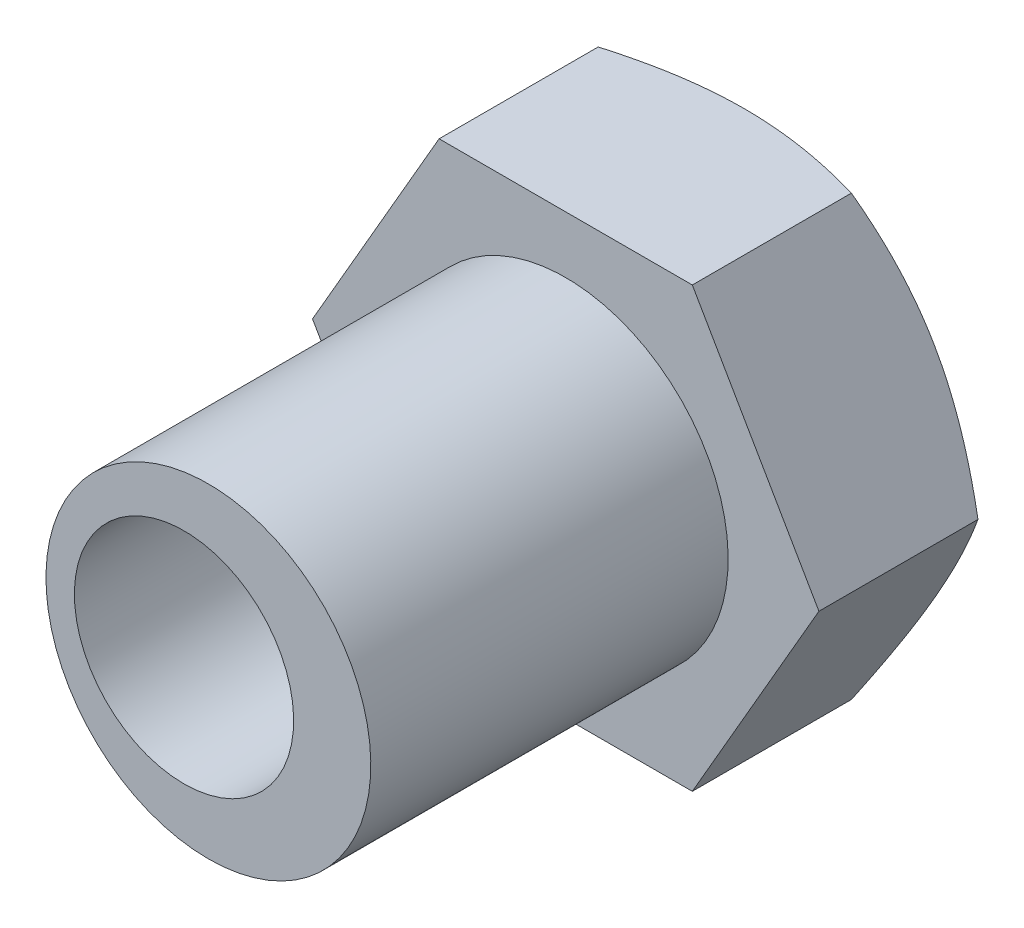
ISO-10303-21;
HEADER;
FILE_DESCRIPTION(('STEP AP214'),'2;1');
FILE_NAME('part.step','',(''),(''),'','','');
FILE_SCHEMA(('AUTOMOTIVE_DESIGN { 1 0 10303 214 1 1 1 1 }'));
ENDSEC;
DATA;
#1=APPLICATION_CONTEXT('core data for automotive mechanical design processes');
#2=APPLICATION_PROTOCOL_DEFINITION('international standard','automotive_design',2000,#1);
#3=PRODUCT_CONTEXT('',#1,'mechanical');
#4=PRODUCT('Part','Part','',(#3));
#5=PRODUCT_RELATED_PRODUCT_CATEGORY('part','',(#4));
#6=PRODUCT_DEFINITION_FORMATION('','',#4);
#7=PRODUCT_DEFINITION_CONTEXT('part definition',#1,'design');
#8=PRODUCT_DEFINITION('design','',#6,#7);
#9=PRODUCT_DEFINITION_SHAPE('','',#8);
#10=(LENGTH_UNIT() NAMED_UNIT(*) SI_UNIT(.MILLI.,.METRE.));
#11=(NAMED_UNIT(*) PLANE_ANGLE_UNIT() SI_UNIT($,.RADIAN.));
#12=(NAMED_UNIT(*) SI_UNIT($,.STERADIAN.) SOLID_ANGLE_UNIT());
#13=UNCERTAINTY_MEASURE_WITH_UNIT(LENGTH_MEASURE(1.E-05),#10,'distance_accuracy_value','');
#14=(GEOMETRIC_REPRESENTATION_CONTEXT(3) GLOBAL_UNCERTAINTY_ASSIGNED_CONTEXT((#13)) GLOBAL_UNIT_ASSIGNED_CONTEXT((#10,
#11,#12)) REPRESENTATION_CONTEXT('',''));
#15=CARTESIAN_POINT('',(0.,0.,0.));
#16=DIRECTION('',(0.,0.,1.));
#17=DIRECTION('',(1.,0.,0.));
#18=AXIS2_PLACEMENT_3D('',#15,#16,#17);
#19=CARTESIAN_POINT('',(73.999999999998,37.5000000000016,-24.2500000000003));
#20=DIRECTION('',(0.,0.,1.));
#21=DIRECTION('',(0.,-1.,0.));
#22=AXIS2_PLACEMENT_3D('',#19,#20,#21);
#23=CYLINDRICAL_SURFACE('',#22,10.);
#24=CARTESIAN_POINT('',(73.999999999998,37.5000000000016,-28.5000000000002));
#25=DIRECTION('',(0.,0.,1.));
#26=DIRECTION('',(0.,-1.,0.));
#27=AXIS2_PLACEMENT_3D('',#24,#25,#26);
#28=CIRCLE('',#27,10.);
#29=CARTESIAN_POINT('',(73.999999999998,27.5000000000016,-28.5000000000003));
#30=VERTEX_POINT('',#29);
#31=EDGE_CURVE('E20',#30,#30,#28,.F.);
#32=ORIENTED_EDGE('',*,*,#31,.T.);
#33=EDGE_LOOP('',(#32));
#34=FACE_BOUND('',#33,.T.);
#35=CARTESIAN_POINT('',(73.999999999998,37.5000000000016,-20.0000000000002));
#36=DIRECTION('',(0.,0.,1.));
#37=DIRECTION('',(0.,-1.,0.));
#38=AXIS2_PLACEMENT_3D('',#35,#36,#37);
#39=CIRCLE('',#38,10.);
#40=CARTESIAN_POINT('',(73.999999999998,27.5000000000016,-20.0000000000002));
#41=VERTEX_POINT('',#40);
#42=EDGE_CURVE('E115',#41,#41,#39,.T.);
#43=ORIENTED_EDGE('',*,*,#42,.T.);
#44=EDGE_LOOP('',(#43));
#45=FACE_BOUND('',#44,.T.);
#46=ADVANCED_FACE('F16',(#34,#45),#23,.F.);
#47=CARTESIAN_POINT('',(89.269999999998,51.0000000000016,-28.4999999999998));
#48=DIRECTION('',(0.,0.,1.));
#49=DIRECTION('',(-1.,0.,0.));
#50=AXIS2_PLACEMENT_3D('',#47,#48,#49);
#51=PLANE('',#50);
#52=ORIENTED_EDGE('',*,*,#31,.F.);
#53=EDGE_LOOP('',(#52));
#54=FACE_BOUND('',#53,.T.);
#55=CARTESIAN_POINT('',(75.499999999998,37.5000000000016,-28.5000000000006));
#56=DIRECTION('',(0.,0.,1.));
#57=DIRECTION('',(0.,-1.,0.));
#58=AXIS2_PLACEMENT_3D('',#55,#56,#57);
#59=CIRCLE('',#58,13.4999999999994);
#60=CARTESIAN_POINT('',(63.8086570489084,44.2500000000015,-28.5000000000002));
#61=VERTEX_POINT('',#60);
#62=CARTESIAN_POINT('',(63.8086570489082,30.7500000000017,-28.5000000000007));
#63=VERTEX_POINT('',#62);
#64=EDGE_CURVE('E86',#61,#63,#59,.T.);
#65=ORIENTED_EDGE('',*,*,#64,.F.);
#66=CARTESIAN_POINT('',(75.4999999999979,37.5000000000016,-28.5000000000004));
#67=DIRECTION('',(0.,0.,1.));
#68=DIRECTION('',(0.,-1.,0.));
#69=AXIS2_PLACEMENT_3D('',#66,#67,#68);
#70=CIRCLE('',#69,13.4999999999997);
#71=CARTESIAN_POINT('',(75.499999999998,51.0000000000015,-28.5000000000014));
#72=VERTEX_POINT('',#71);
#73=EDGE_CURVE('E377',#72,#61,#70,.T.);
#74=ORIENTED_EDGE('',*,*,#73,.F.);
#75=CARTESIAN_POINT('',(75.499999999998,37.5000000000016,-28.5000000000033));
#76=DIRECTION('',(0.,0.,1.));
#77=DIRECTION('',(0.,-1.,0.));
#78=AXIS2_PLACEMENT_3D('',#75,#76,#77);
#79=CIRCLE('',#78,13.4999999999948);
#80=CARTESIAN_POINT('',(87.1913429510856,44.2500000000003,-28.5000000000016));
#81=VERTEX_POINT('',#80);
#82=EDGE_CURVE('E374',#81,#72,#79,.T.);
#83=ORIENTED_EDGE('',*,*,#82,.F.);
#84=CARTESIAN_POINT('',(75.499999999998,37.5000000000016,-28.5000000000028));
#85=DIRECTION('',(0.,0.,1.));
#86=DIRECTION('',(0.,-1.,0.));
#87=AXIS2_PLACEMENT_3D('',#84,#85,#86);
#88=CIRCLE('',#87,13.4999999999956);
#89=CARTESIAN_POINT('',(87.191342951086,30.7500000000027,-28.5000000000017));
#90=VERTEX_POINT('',#89);
#91=EDGE_CURVE('E372',#90,#81,#88,.T.);
#92=ORIENTED_EDGE('',*,*,#91,.F.);
#93=CARTESIAN_POINT('',(75.499999999998,37.5000000000016,-28.5000000000003));
#94=DIRECTION('',(0.,0.,1.));
#95=DIRECTION('',(0.,-1.,0.));
#96=AXIS2_PLACEMENT_3D('',#93,#94,#95);
#97=CIRCLE('',#96,13.4999999999999);
#98=CARTESIAN_POINT('',(75.499999999998,24.0000000000016,-28.5000000000007));
#99=VERTEX_POINT('',#98);
#100=EDGE_CURVE('E93',#99,#90,#97,.T.);
#101=ORIENTED_EDGE('',*,*,#100,.F.);
#102=CARTESIAN_POINT('',(75.499999999998,37.5000000000016,-28.5000000000004));
#103=DIRECTION('',(0.,0.,1.));
#104=DIRECTION('',(0.,-1.,0.));
#105=AXIS2_PLACEMENT_3D('',#102,#103,#104);
#106=CIRCLE('',#105,13.4999999999997);
#107=EDGE_CURVE('E89',#63,#99,#106,.T.);
#108=ORIENTED_EDGE('',*,*,#107,.F.);
#109=EDGE_LOOP('',(#65,#74,#83,#92,#101,#108));
#110=FACE_BOUND('',#109,.T.);
#111=ADVANCED_FACE('F91',(#54,#110),#51,.F.);
#112=CARTESIAN_POINT('',(82.3749999999981,37.5000000000016,-20.0000000000002));
#113=DIRECTION('',(0.,0.,1.));
#114=DIRECTION('',(1.,0.,0.));
#115=AXIS2_PLACEMENT_3D('',#112,#113,#114);
#116=PLANE('',#115);
#117=CARTESIAN_POINT('',(73.9999999999981,37.5000000000016,-20.0000000000003));
#118=DIRECTION('',(0.,0.,1.));
#119=DIRECTION('',(0.,-1.,0.));
#120=AXIS2_PLACEMENT_3D('',#117,#118,#119);
#121=CIRCLE('',#120,6.75);
#122=CARTESIAN_POINT('',(73.9999999999981,30.7500000000016,-20.0000000000003));
#123=VERTEX_POINT('',#122);
#124=EDGE_CURVE('E378',#123,#123,#121,.T.);
#125=ORIENTED_EDGE('',*,*,#124,.T.);
#126=EDGE_LOOP('',(#125));
#127=FACE_BOUND('',#126,.T.);
#128=ORIENTED_EDGE('',*,*,#42,.F.);
#129=EDGE_LOOP('',(#128));
#130=FACE_BOUND('',#129,.T.);
#131=ADVANCED_FACE('F145',(#127,#130),#116,.F.);
#132=CARTESIAN_POINT('',(75.499999999998,37.5000000000016,-28.5000000000007));
#133=DIRECTION('',(0.,0.,1.));
#134=DIRECTION('',(0.,-1.,0.));
#135=AXIS2_PLACEMENT_3D('',#132,#133,#134);
#136=CONICAL_SURFACE('',#135,13.4999999999992,1.0471975511966);
#137=ORIENTED_EDGE('',*,*,#64,.T.);
#138=CARTESIAN_POINT('',(59.9115427318789,37.5000000000001,-27.2942286340607));
#139=CARTESIAN_POINT('',(60.0702151604618,37.2251712919342,-27.3858314835547));
#140=CARTESIAN_POINT('',(60.229458589809,36.9493535815334,-27.4735816589641));
#141=CARTESIAN_POINT('',(60.5491187593896,36.3956859266638,-27.640386763792));
#142=CARTESIAN_POINT('',(60.7095357739104,36.1178355071151,-27.7194395864347));
#143=CARTESIAN_POINT('',(61.030676813897,35.5616029094629,-27.8674365203982));
#144=CARTESIAN_POINT('',(61.1913951024062,35.2832306680595,-27.9364301240182));
#145=CARTESIAN_POINT('',(61.5138789902333,34.7246721897206,-28.0637526904588));
#146=CARTESIAN_POINT('',(61.6756445251123,34.4444860643965,-28.1220823031151));
#147=CARTESIAN_POINT('',(62.0003199366063,33.8821317557207,-28.2271534346445));
#148=CARTESIAN_POINT('',(62.1632309581107,33.5999615893621,-28.2738808920245));
#149=CARTESIAN_POINT('',(62.4898305916675,33.0342744303084,-28.354760455346));
#150=CARTESIAN_POINT('',(62.6535191831387,32.7507574732609,-28.3889128922716));
#151=CARTESIAN_POINT('',(62.9822863557921,32.1813160263644,-28.4440638216634));
#152=CARTESIAN_POINT('',(63.1473677896904,31.8953865954663,-28.4649954199093));
#153=CARTESIAN_POINT('',(63.3952171068726,31.4660989854853,-28.485973758651));
#154=CARTESIAN_POINT('',(63.4778816043817,31.3229198758175,-28.4912300339026));
#155=CARTESIAN_POINT('',(63.643248892801,31.0364953303653,-28.4982444398016));
#156=CARTESIAN_POINT('',(63.725951684265,30.8932498936219,-28.5000025181774));
#157=CARTESIAN_POINT('',(63.8086570489081,30.7500000000016,-28.5000000000005));
#158=B_SPLINE_CURVE_WITH_KNOTS('',3,(#138,#139,#140,#141,#142,#143,#144,#145,#146,#147,#148,
#149,#150,#151,#152,#153,#154,#155,#156,#157),.UNSPECIFIED.,.F.,.F.,(4,2,2,2,2,2,2,2,2,4),(0.,
0.990921857450484,1.98208322168567,2.96819029848637,3.95423726445526,4.94147352204391,
5.92868379296465,6.92084991532655,7.41705524609306,7.91326799133399),.UNSPECIFIED.);
#159=CARTESIAN_POINT('',(59.9115427318788,37.5000000000014,-27.2942286340606));
#160=VERTEX_POINT('',#159);
#161=EDGE_CURVE('E112',#160,#63,#158,.T.);
#162=ORIENTED_EDGE('',*,*,#161,.F.);
#163=CARTESIAN_POINT('',(63.8086570489081,44.2500000000016,-28.5000000000001));
#164=CARTESIAN_POINT('',(63.725951684265,44.1067501063812,-28.500002518177));
#165=CARTESIAN_POINT('',(63.6432488928011,43.9635046696378,-28.4982444398012));
#166=CARTESIAN_POINT('',(63.4778816043817,43.6770801241857,-28.4912300339022));
#167=CARTESIAN_POINT('',(63.3952171068726,43.5339010145178,-28.4859737586507));
#168=CARTESIAN_POINT('',(63.1473677896903,43.1046134045368,-28.464995419909));
#169=CARTESIAN_POINT('',(62.9822863557921,42.8186839736387,-28.4440638216631));
#170=CARTESIAN_POINT('',(62.6535191831386,42.2492425267422,-28.3889128922713));
#171=CARTESIAN_POINT('',(62.4898305916674,41.9657255696946,-28.3547604553457));
#172=CARTESIAN_POINT('',(62.1632309581107,41.4000384106409,-28.2738808920242));
#173=CARTESIAN_POINT('',(62.0003199366062,41.1178682442823,-28.2271534346443));
#174=CARTESIAN_POINT('',(61.6756445251123,40.5555139356064,-28.1220823031149));
#175=CARTESIAN_POINT('',(61.5138789902332,40.2753278102824,-28.0637526904586));
#176=CARTESIAN_POINT('',(61.1913951024061,39.7167693319434,-27.936430124018));
#177=CARTESIAN_POINT('',(61.0306768138969,39.4383970905399,-27.867436520398));
#178=CARTESIAN_POINT('',(60.7095357739103,38.8821644928877,-27.7194395864346));
#179=CARTESIAN_POINT('',(60.5491187593894,38.604314073339,-27.6403867637919));
#180=CARTESIAN_POINT('',(60.2294585898088,38.0506464184694,-27.473581658964));
#181=CARTESIAN_POINT('',(60.0702151604617,37.7748287080686,-27.3858314835546));
#182=CARTESIAN_POINT('',(59.9115427318788,37.5000000000026,-27.2942286340606));
#183=B_SPLINE_CURVE_WITH_KNOTS('',3,(#163,#164,#165,#166,#167,#168,#169,#170,#171,#172,#173,
#174,#175,#176,#177,#178,#179,#180,#181,#182),.UNSPECIFIED.,.F.,.F.,(4,2,2,2,2,2,2,2,2,4),(0.,
0.496212745240965,0.9924180760075,1.98458419836945,2.97179446929025,3.95903072687894,
4.94507769284789,5.93118476964864,6.92234613388389,7.91326799133441),.UNSPECIFIED.);
#184=EDGE_CURVE('E106',#61,#160,#183,.T.);
#185=ORIENTED_EDGE('',*,*,#184,.F.);
#186=EDGE_LOOP('',(#137,#162,#185));
#187=FACE_BOUND('',#186,.T.);
#188=ADVANCED_FACE('F111',(#187),#136,.T.);
#189=CARTESIAN_POINT('',(75.499999999998,37.5000000000016,-28.5000000000005));
#190=DIRECTION('',(0.,0.,1.));
#191=DIRECTION('',(0.,-1.,0.));
#192=AXIS2_PLACEMENT_3D('',#189,#190,#191);
#193=CONICAL_SURFACE('',#192,13.4999999999997,1.0471975511966);
#194=CARTESIAN_POINT('',(63.8086570489081,30.7500000000016,-28.5000000000005));
#195=CARTESIAN_POINT('',(63.8913624135512,30.6067501063812,-28.5000025181774));
#196=CARTESIAN_POINT('',(63.9740652050152,30.4635046696378,-28.4982444398016));
#197=CARTESIAN_POINT('',(64.1394324934346,30.1770801241855,-28.4912300339026));
#198=CARTESIAN_POINT('',(64.2220969909436,30.0339010145177,-28.4859737586511));
#199=CARTESIAN_POINT('',(64.469946308126,29.6046134045366,-28.4649954199094));
#200=CARTESIAN_POINT('',(64.6350277420243,29.3186839736384,-28.4440638216634));
#201=CARTESIAN_POINT('',(64.9637949146778,28.7492425267418,-28.3889128922716));
#202=CARTESIAN_POINT('',(65.127483506149,28.4657255696942,-28.354760455346));
#203=CARTESIAN_POINT('',(65.4540831397059,27.9000384106404,-28.2738808920246));
#204=CARTESIAN_POINT('',(65.6169941612103,27.6178682442817,-28.2271534346446));
#205=CARTESIAN_POINT('',(65.9416695727044,27.0555139356057,-28.1220823031152));
#206=CARTESIAN_POINT('',(66.1034351075834,26.7753278102816,-28.0637526904588));
#207=CARTESIAN_POINT('',(66.4259189954106,26.2167693319426,-27.9364301240182));
#208=CARTESIAN_POINT('',(66.5866372839199,25.938397090539,-27.8674365203982));
#209=CARTESIAN_POINT('',(66.9077783239065,25.3821644928867,-27.7194395864347));
#210=CARTESIAN_POINT('',(67.0681953384274,25.104314073338,-27.640386763792));
#211=CARTESIAN_POINT('',(67.387855508008,24.5506464184683,-27.473581658964));
#212=CARTESIAN_POINT('',(67.5470989373552,24.2748287080674,-27.3858314835546));
#213=CARTESIAN_POINT('',(67.7057713659381,24.0000000000014,-27.2942286340606));
#214=B_SPLINE_CURVE_WITH_KNOTS('',3,(#194,#195,#196,#197,#198,#199,#200,#201,#202,#203,#204,
#205,#206,#207,#208,#209,#210,#211,#212,#213),.UNSPECIFIED.,.F.,.F.,(4,2,2,2,2,2,2,2,2,4),(0.,
0.496212745241068,0.992418076007683,1.98458419836983,2.9717944692908,3.95903072687966,
4.94507769284879,5.93118476964972,6.92234613388513,7.91326799133584),.UNSPECIFIED.);
#215=CARTESIAN_POINT('',(67.7057713659381,24.0000000000014,-27.2942286340606));
#216=VERTEX_POINT('',#215);
#217=EDGE_CURVE('E99',#63,#216,#214,.T.);
#218=ORIENTED_EDGE('',*,*,#217,.F.);
#219=ORIENTED_EDGE('',*,*,#107,.T.);
#220=CARTESIAN_POINT('',(67.7057713659381,24.0000000000015,-27.2942286340606));
#221=CARTESIAN_POINT('',(68.023116223104,24.0000000000015,-27.3858314835546));
#222=CARTESIAN_POINT('',(68.3416030817984,24.0000000000015,-27.4735816589641));
#223=CARTESIAN_POINT('',(68.9809234209597,24.0000000000015,-27.640386763792));
#224=CARTESIAN_POINT('',(69.3017574500015,24.0000000000015,-27.7194395864348));
#225=CARTESIAN_POINT('',(69.9440395299747,24.0000000000015,-27.8674365203983));
#226=CARTESIAN_POINT('',(70.2654761069932,24.0000000000015,-27.9364301240183));
#227=CARTESIAN_POINT('',(70.9104438826475,24.0000000000015,-28.0637526904589));
#228=CARTESIAN_POINT('',(71.2339749524056,24.0000000000015,-28.1220823031153));
#229=CARTESIAN_POINT('',(71.8833257753936,24.0000000000015,-28.2271534346447));
#230=CARTESIAN_POINT('',(72.2091478184026,24.0000000000015,-28.2738808920247));
#231=CARTESIAN_POINT('',(72.8623470855162,24.0000000000015,-28.3547604553461));
#232=CARTESIAN_POINT('',(73.1897242684587,24.0000000000015,-28.3889128922717));
#233=CARTESIAN_POINT('',(73.8472586137657,24.0000000000015,-28.4440638216636));
#234=CARTESIAN_POINT('',(74.1774214815622,24.0000000000015,-28.4649954199095));
#235=CARTESIAN_POINT('',(74.6731201159269,24.0000000000015,-28.4859737586512));
#236=CARTESIAN_POINT('',(74.838449110945,24.0000000000015,-28.4912300339028));
#237=CARTESIAN_POINT('',(75.1691836877837,24.0000000000015,-28.4982444398018));
#238=CARTESIAN_POINT('',(75.3345892707117,24.0000000000015,-28.5000025181776));
#239=CARTESIAN_POINT('',(75.499999999998,24.0000000000015,-28.5000000000007));
#240=B_SPLINE_CURVE_WITH_KNOTS('',3,(#220,#221,#222,#223,#224,#225,#226,#227,#228,#229,#230,
#231,#232,#233,#234,#235,#236,#237,#238,#239),.UNSPECIFIED.,.F.,.F.,(4,2,2,2,2,2,2,2,2,4),(0.,
0.990921857450691,1.98208322168606,2.96819029848695,3.95423726445605,4.94147352204486,
5.92868379296579,6.92084991532789,7.4170552460945,7.91326799133554),.UNSPECIFIED.);
#241=EDGE_CURVE('E101',#216,#99,#240,.T.);
#242=ORIENTED_EDGE('',*,*,#241,.F.);
#243=EDGE_LOOP('',(#218,#219,#242));
#244=FACE_BOUND('',#243,.T.);
#245=ADVANCED_FACE('F100',(#244),#193,.T.);
#246=CARTESIAN_POINT('',(75.499999999998,37.5000000000016,-28.5000000000005));
#247=DIRECTION('',(0.,0.,1.));
#248=DIRECTION('',(0.,-1.,0.));
#249=AXIS2_PLACEMENT_3D('',#246,#247,#248);
#250=CONICAL_SURFACE('',#249,13.4999999999997,1.0471975511966);
#251=CARTESIAN_POINT('',(75.499999999998,24.0000000000015,-28.5000000000007));
#252=CARTESIAN_POINT('',(75.6654107292842,24.0000000000015,-28.5000025181776));
#253=CARTESIAN_POINT('',(75.8308163122122,24.0000000000015,-28.4982444398018));
#254=CARTESIAN_POINT('',(76.1615508890509,24.0000000000015,-28.4912300339028));
#255=CARTESIAN_POINT('',(76.326879884069,24.0000000000015,-28.4859737586512));
#256=CARTESIAN_POINT('',(76.8225785184337,24.0000000000015,-28.4649954199095));
#257=CARTESIAN_POINT('',(77.1527413862302,24.0000000000015,-28.4440638216636));
#258=CARTESIAN_POINT('',(77.8102757315372,24.0000000000015,-28.3889128922717));
#259=CARTESIAN_POINT('',(78.1376529144797,24.0000000000015,-28.3547604553461));
#260=CARTESIAN_POINT('',(78.7908521815934,24.0000000000015,-28.2738808920247));
#261=CARTESIAN_POINT('',(79.1166742246023,24.0000000000015,-28.2271534346447));
#262=CARTESIAN_POINT('',(79.7660250475903,24.0000000000015,-28.1220823031153));
#263=CARTESIAN_POINT('',(80.0895561173484,24.0000000000015,-28.0637526904589));
#264=CARTESIAN_POINT('',(80.7345238930028,24.0000000000015,-27.9364301240183));
#265=CARTESIAN_POINT('',(81.0559604700213,24.0000000000015,-27.8674365203983));
#266=CARTESIAN_POINT('',(81.6982425499945,24.0000000000015,-27.7194395864347));
#267=CARTESIAN_POINT('',(82.0190765790363,24.0000000000015,-27.640386763792));
#268=CARTESIAN_POINT('',(82.6583969181975,24.0000000000015,-27.4735816589641));
#269=CARTESIAN_POINT('',(82.9768837768919,24.0000000000015,-27.3858314835546));
#270=CARTESIAN_POINT('',(83.2942286340578,24.0000000000015,-27.2942286340606));
#271=B_SPLINE_CURVE_WITH_KNOTS('',3,(#251,#252,#253,#254,#255,#256,#257,#258,#259,#260,#261,
#262,#263,#264,#265,#266,#267,#268,#269,#270),.UNSPECIFIED.,.F.,.F.,(4,2,2,2,2,2,2,2,2,4),(0.,
0.496212745241032,0.992418076007652,1.98458419836973,2.97179446929066,3.9590307268795,
4.94507769284859,5.93118476964948,6.92234613388487,7.91326799133556),.UNSPECIFIED.);
#272=CARTESIAN_POINT('',(83.2942286340578,24.0000000000014,-27.2942286340606));
#273=VERTEX_POINT('',#272);
#274=EDGE_CURVE('E119',#99,#273,#271,.T.);
#275=ORIENTED_EDGE('',*,*,#274,.F.);
#276=ORIENTED_EDGE('',*,*,#100,.T.);
#277=CARTESIAN_POINT('',(83.2942286340578,24.0000000000014,-27.2942286340606));
#278=CARTESIAN_POINT('',(83.4529010626408,24.2748287080674,-27.3858314835546));
#279=CARTESIAN_POINT('',(83.612144491988,24.5506464184682,-27.473581658964));
#280=CARTESIAN_POINT('',(83.9318046615686,25.104314073338,-27.6403867637919));
#281=CARTESIAN_POINT('',(84.0922216760895,25.3821644928867,-27.7194395864347));
#282=CARTESIAN_POINT('',(84.4133627160761,25.938397090539,-27.8674365203982));
#283=CARTESIAN_POINT('',(84.5740810045854,26.2167693319426,-27.9364301240182));
#284=CARTESIAN_POINT('',(84.8965648924126,26.7753278102816,-28.0637526904588));
#285=CARTESIAN_POINT('',(85.0583304272917,27.0555139356057,-28.1220823031152));
#286=CARTESIAN_POINT('',(85.3830058387857,27.6178682442817,-28.2271534346445));
#287=CARTESIAN_POINT('',(85.5459168602902,27.9000384106404,-28.2738808920245));
#288=CARTESIAN_POINT('',(85.872516493847,28.4657255696942,-28.354760455346));
#289=CARTESIAN_POINT('',(86.0362050853182,28.7492425267418,-28.3889128922716));
#290=CARTESIAN_POINT('',(86.3649722579718,29.3186839736385,-28.4440638216634));
#291=CARTESIAN_POINT('',(86.53005369187,29.6046134045366,-28.4649954199094));
#292=CARTESIAN_POINT('',(86.7779030090524,30.0339010145177,-28.4859737586511));
#293=CARTESIAN_POINT('',(86.8605675065615,30.1770801241856,-28.4912300339026));
#294=CARTESIAN_POINT('',(87.0259347949808,30.4635046696378,-28.4982444398016));
#295=CARTESIAN_POINT('',(87.1086375864448,30.6067501063812,-28.5000025181774));
#296=CARTESIAN_POINT('',(87.1913429510879,30.7500000000016,-28.5000000000005));
#297=B_SPLINE_CURVE_WITH_KNOTS('',3,(#277,#278,#279,#280,#281,#282,#283,#284,#285,#286,#287,
#288,#289,#290,#291,#292,#293,#294,#295,#296),.UNSPECIFIED.,.F.,.F.,(4,2,2,2,2,2,2,2,2,4),(0.,
0.990921857450719,1.98208322168615,2.96819029848709,3.95423726445623,4.94147352204511,
5.9286837929661,6.92084991532825,7.41705524609486,7.91326799133592),.UNSPECIFIED.);
#298=EDGE_CURVE('E246',#273,#90,#297,.T.);
#299=ORIENTED_EDGE('',*,*,#298,.F.);
#300=EDGE_LOOP('',(#275,#276,#299));
#301=FACE_BOUND('',#300,.T.);
#302=ADVANCED_FACE('F278',(#301),#250,.T.);
#303=CARTESIAN_POINT('',(75.499999999998,37.5000000000016,-28.5000000000036));
#304=DIRECTION('',(0.,0.,1.));
#305=DIRECTION('',(0.,-1.,0.));
#306=AXIS2_PLACEMENT_3D('',#303,#304,#305);
#307=CONICAL_SURFACE('',#306,13.4999999999941,1.04719755119659);
#308=ORIENTED_EDGE('',*,*,#91,.T.);
#309=CARTESIAN_POINT('',(91.0884572681179,37.5000000000014,-27.2942286340601));
#310=CARTESIAN_POINT('',(90.929784839535,37.7748287080674,-27.3858314835541));
#311=CARTESIAN_POINT('',(90.7705414101878,38.0506464184682,-27.4735816589636));
#312=CARTESIAN_POINT('',(90.4508812406072,38.6043140733379,-27.6403867637915));
#313=CARTESIAN_POINT('',(90.2904642260863,38.8821644928867,-27.7194395864342));
#314=CARTESIAN_POINT('',(89.9693231860997,39.438397090539,-27.8674365203977));
#315=CARTESIAN_POINT('',(89.8086048975904,39.7167693319426,-27.9364301240177));
#316=CARTESIAN_POINT('',(89.4861210097632,40.2753278102816,-28.0637526904584));
#317=CARTESIAN_POINT('',(89.3243554748841,40.5555139356057,-28.1220823031147));
#318=CARTESIAN_POINT('',(88.9996800633901,41.1178682442817,-28.2271534346441));
#319=CARTESIAN_POINT('',(88.8367690418857,41.4000384106404,-28.2738808920241));
#320=CARTESIAN_POINT('',(88.5101694083288,41.9657255696942,-28.3547604553456));
#321=CARTESIAN_POINT('',(88.3464808168576,42.2492425267418,-28.3889128922712));
#322=CARTESIAN_POINT('',(88.0177136442041,42.8186839736384,-28.444063821663));
#323=CARTESIAN_POINT('',(87.8526322103058,43.1046134045366,-28.464995419909));
#324=CARTESIAN_POINT('',(87.6047828931234,43.5339010145177,-28.4859737586506));
#325=CARTESIAN_POINT('',(87.5221183956144,43.6770801241856,-28.4912300339022));
#326=CARTESIAN_POINT('',(87.356751107195,43.9635046696378,-28.4982444398012));
#327=CARTESIAN_POINT('',(87.274048315731,44.1067501063812,-28.500002518177));
#328=CARTESIAN_POINT('',(87.1913429510879,44.2500000000016,-28.5));
#329=B_SPLINE_CURVE_WITH_KNOTS('',3,(#309,#310,#311,#312,#313,#314,#315,#316,#317,#318,#319,
#320,#321,#322,#323,#324,#325,#326,#327,#328),.UNSPECIFIED.,.F.,.F.,(4,2,2,2,2,2,2,2,2,4),(0.,
0.990921857450707,1.98208322168613,2.96819029848708,3.95423726445619,4.94147352204506,
5.92868379296604,6.9208499153282,7.41705524609483,7.91326799133588),.UNSPECIFIED.);
#330=CARTESIAN_POINT('',(91.0884572681179,37.5000000000015,-27.2942286340601));
#331=VERTEX_POINT('',#330);
#332=EDGE_CURVE('E259',#331,#81,#329,.T.);
#333=ORIENTED_EDGE('',*,*,#332,.F.);
#334=CARTESIAN_POINT('',(87.1913429510879,30.7500000000016,-28.5000000000004));
#335=CARTESIAN_POINT('',(87.2740483157311,30.893249893622,-28.5000025181774));
#336=CARTESIAN_POINT('',(87.3567511071951,31.0364953303654,-28.4982444398016));
#337=CARTESIAN_POINT('',(87.5221183956144,31.3229198758176,-28.4912300339025));
#338=CARTESIAN_POINT('',(87.6047828931235,31.4660989854855,-28.485973758651));
#339=CARTESIAN_POINT('',(87.8526322103058,31.8953865954666,-28.4649954199093));
#340=CARTESIAN_POINT('',(88.0177136442041,32.1813160263647,-28.4440638216633));
#341=CARTESIAN_POINT('',(88.3464808168576,32.7507574732613,-28.3889128922714));
#342=CARTESIAN_POINT('',(88.5101694083289,33.0342744303089,-28.3547604553458));
#343=CARTESIAN_POINT('',(88.8367690418857,33.5999615893627,-28.2738808920243));
#344=CARTESIAN_POINT('',(88.9996800633902,33.8821317557214,-28.2271534346443));
#345=CARTESIAN_POINT('',(89.3243554748842,34.4444860643974,-28.1220823031149));
#346=CARTESIAN_POINT('',(89.4861210097632,34.7246721897214,-28.0637526904585));
#347=CARTESIAN_POINT('',(89.8086048975904,35.2832306680605,-27.9364301240179));
#348=CARTESIAN_POINT('',(89.9693231860997,35.561602909464,-27.8674365203979));
#349=CARTESIAN_POINT('',(90.2904642260863,36.1178355071163,-27.7194395864343));
#350=CARTESIAN_POINT('',(90.4508812406072,36.395685926665,-27.6403867637916));
#351=CARTESIAN_POINT('',(90.7705414101878,36.9493535815347,-27.4735816589636));
#352=CARTESIAN_POINT('',(90.929784839535,37.2251712919356,-27.3858314835542));
#353=CARTESIAN_POINT('',(91.0884572681179,37.5000000000016,-27.2942286340601));
#354=B_SPLINE_CURVE_WITH_KNOTS('',3,(#334,#335,#336,#337,#338,#339,#340,#341,#342,#343,#344,
#345,#346,#347,#348,#349,#350,#351,#352,#353),.UNSPECIFIED.,.F.,.F.,(4,2,2,2,2,2,2,2,2,4),(0.,
0.496212745241062,0.992418076007673,1.98458419836979,2.97179446929074,3.95903072687959,
4.94507769284869,5.93118476964961,6.92234613388501,7.91326799133569),.UNSPECIFIED.);
#355=EDGE_CURVE('E247',#90,#331,#354,.T.);
#356=ORIENTED_EDGE('',*,*,#355,.F.);
#357=EDGE_LOOP('',(#308,#333,#356));
#358=FACE_BOUND('',#357,.T.);
#359=ADVANCED_FACE('F275',(#358),#307,.T.);
#360=CARTESIAN_POINT('',(75.499999999998,37.5000000000016,-28.5000000000043));
#361=DIRECTION('',(0.,0.,1.));
#362=DIRECTION('',(0.,-1.,0.));
#363=AXIS2_PLACEMENT_3D('',#360,#361,#362);
#364=CONICAL_SURFACE('',#363,13.499999999993,1.0471975511966);
#365=ORIENTED_EDGE('',*,*,#82,.T.);
#366=CARTESIAN_POINT('',(83.2942286340547,51.0000000000015,-27.2942286340607));
#367=CARTESIAN_POINT('',(82.9768837768889,51.0000000000015,-27.3858314835547));
#368=CARTESIAN_POINT('',(82.6583969181947,51.0000000000015,-27.473581658964));
#369=CARTESIAN_POINT('',(82.0190765790337,51.0000000000015,-27.6403867637919));
#370=CARTESIAN_POINT('',(81.698242549992,51.0000000000015,-27.7194395864346));
#371=CARTESIAN_POINT('',(81.055960470019,51.0000000000015,-27.867436520398));
#372=CARTESIAN_POINT('',(80.7345238930007,51.0000000000015,-27.9364301240179));
#373=CARTESIAN_POINT('',(80.0895561173466,51.0000000000015,-28.0637526904584));
#374=CARTESIAN_POINT('',(79.7660250475886,51.0000000000015,-28.1220823031148));
#375=CARTESIAN_POINT('',(79.1166742246008,51.0000000000015,-28.2271534346441));
#376=CARTESIAN_POINT('',(78.790852181592,51.0000000000015,-28.2738808920241));
#377=CARTESIAN_POINT('',(78.1376529144786,51.0000000000015,-28.3547604553455));
#378=CARTESIAN_POINT('',(77.8102757315363,51.0000000000015,-28.388912892271));
#379=CARTESIAN_POINT('',(77.1527413862296,51.0000000000015,-28.4440638216628));
#380=CARTESIAN_POINT('',(76.8225785184332,51.0000000000015,-28.4649954199088));
#381=CARTESIAN_POINT('',(76.3268798840687,51.0000000000015,-28.4859737586505));
#382=CARTESIAN_POINT('',(76.1615508890506,51.0000000000015,-28.491230033902));
#383=CARTESIAN_POINT('',(75.830816312212,51.0000000000015,-28.498244439801));
#384=CARTESIAN_POINT('',(75.6654107292841,51.0000000000015,-28.5000025181768));
#385=CARTESIAN_POINT('',(75.499999999998,51.0000000000015,-28.4999999999999));
#386=B_SPLINE_CURVE_WITH_KNOTS('',3,(#366,#367,#368,#369,#370,#371,#372,#373,#374,#375,#376,
#377,#378,#379,#380,#381,#382,#383,#384,#385),.UNSPECIFIED.,.F.,.F.,(4,2,2,2,2,2,2,2,2,4),(0.,
0.99092185745028,1.98208322168525,2.96819029848576,3.95423726445444,4.94147352204287,
5.92868379296341,6.92084991532509,7.4170552460915,7.91326799133232),.UNSPECIFIED.);
#387=CARTESIAN_POINT('',(83.2942286340563,51.0000000000015,-27.2942286340603));
#388=VERTEX_POINT('',#387);
#389=EDGE_CURVE('E184',#388,#72,#386,.T.);
#390=ORIENTED_EDGE('',*,*,#389,.F.);
#391=CARTESIAN_POINT('',(87.1913429510879,44.2500000000016,-28.5));
#392=CARTESIAN_POINT('',(87.1086375864448,44.3932498936219,-28.500002518177));
#393=CARTESIAN_POINT('',(87.0259347949808,44.5364953303654,-28.4982444398012));
#394=CARTESIAN_POINT('',(86.8605675065614,44.8229198758176,-28.4912300339021));
#395=CARTESIAN_POINT('',(86.7779030090524,44.9660989854855,-28.4859737586506));
#396=CARTESIAN_POINT('',(86.53005369187,45.3953865954665,-28.4649954199089));
#397=CARTESIAN_POINT('',(86.3649722579717,45.6813160263647,-28.4440638216629));
#398=CARTESIAN_POINT('',(86.0362050853182,46.2507574732613,-28.3889128922711));
#399=CARTESIAN_POINT('',(85.872516493847,46.5342744303089,-28.3547604553454));
#400=CARTESIAN_POINT('',(85.5459168602902,47.0999615893627,-28.2738808920239));
#401=CARTESIAN_POINT('',(85.3830058387857,47.3821317557214,-28.2271534346439));
#402=CARTESIAN_POINT('',(85.0583304272917,47.9444860643973,-28.1220823031145));
#403=CARTESIAN_POINT('',(84.8965648924126,48.2246721897214,-28.0637526904581));
#404=CARTESIAN_POINT('',(84.5740810045854,48.7832306680604,-27.9364301240175));
#405=CARTESIAN_POINT('',(84.4133627160762,49.061602909464,-27.8674365203975));
#406=CARTESIAN_POINT('',(84.0922216760896,49.6178355071163,-27.7194395864339));
#407=CARTESIAN_POINT('',(83.9318046615687,49.895685926665,-27.6403867637912));
#408=CARTESIAN_POINT('',(83.6121444919881,50.4493535815347,-27.4735816589632));
#409=CARTESIAN_POINT('',(83.4529010626409,50.7251712919356,-27.3858314835538));
#410=CARTESIAN_POINT('',(83.2942286340579,51.0000000000015,-27.2942286340598));
#411=B_SPLINE_CURVE_WITH_KNOTS('',3,(#391,#392,#393,#394,#395,#396,#397,#398,#399,#400,#401,
#402,#403,#404,#405,#406,#407,#408,#409,#410),.UNSPECIFIED.,.F.,.F.,(4,2,2,2,2,2,2,2,2,4),(0.,
0.496212745241052,0.992418076007663,1.98458419836978,2.97179446929074,3.95903072687959,
4.94507769284869,5.9311847696496,6.92234613388499,7.91326799133569),.UNSPECIFIED.);
#412=EDGE_CURVE('E242',#81,#388,#411,.T.);
#413=ORIENTED_EDGE('',*,*,#412,.F.);
#414=EDGE_LOOP('',(#365,#390,#413));
#415=FACE_BOUND('',#414,.T.);
#416=ADVANCED_FACE('F169',(#415),#364,.T.);
#417=CARTESIAN_POINT('',(75.4999999999979,37.5000000000016,-28.5000000000005));
#418=DIRECTION('',(0.,0.,1.));
#419=DIRECTION('',(0.,-1.,0.));
#420=AXIS2_PLACEMENT_3D('',#417,#418,#419);
#421=CONICAL_SURFACE('',#420,13.4999999999996,1.0471975511966);
#422=ORIENTED_EDGE('',*,*,#73,.T.);
#423=CARTESIAN_POINT('',(67.7057713659382,51.0000000000017,-27.2942286340598));
#424=CARTESIAN_POINT('',(67.5470989373552,50.7251712919357,-27.3858314835538));
#425=CARTESIAN_POINT('',(67.387855508008,50.4493535815348,-27.4735816589632));
#426=CARTESIAN_POINT('',(67.0681953384274,49.8956859266651,-27.6403867637912));
#427=CARTESIAN_POINT('',(66.9077783239065,49.6178355071164,-27.7194395864339));
#428=CARTESIAN_POINT('',(66.5866372839199,49.0616029094641,-27.8674365203975));
#429=CARTESIAN_POINT('',(66.4259189954106,48.7832306680605,-27.9364301240175));
#430=CARTESIAN_POINT('',(66.1034351075834,48.2246721897215,-28.0637526904582));
#431=CARTESIAN_POINT('',(65.9416695727044,47.9444860643974,-28.1220823031145));
#432=CARTESIAN_POINT('',(65.6169941612104,47.3821317557214,-28.227153434644));
#433=CARTESIAN_POINT('',(65.4540831397059,47.0999615893627,-28.273880892024));
#434=CARTESIAN_POINT('',(65.1274835061491,46.5342744303089,-28.3547604553455));
#435=CARTESIAN_POINT('',(64.9637949146778,46.2507574732614,-28.3889128922711));
#436=CARTESIAN_POINT('',(64.6350277420243,45.6813160263647,-28.4440638216629));
#437=CARTESIAN_POINT('',(64.469946308126,45.3953865954666,-28.4649954199089));
#438=CARTESIAN_POINT('',(64.2220969909437,44.9660989854855,-28.4859737586506));
#439=CARTESIAN_POINT('',(64.1394324934346,44.8229198758176,-28.4912300339022));
#440=CARTESIAN_POINT('',(63.9740652050152,44.5364953303654,-28.4982444398012));
#441=CARTESIAN_POINT('',(63.8913624135512,44.393249893622,-28.500002518177));
#442=CARTESIAN_POINT('',(63.8086570489081,44.2500000000016,-28.5000000000001));
#443=B_SPLINE_CURVE_WITH_KNOTS('',3,(#423,#424,#425,#426,#427,#428,#429,#430,#431,#432,#433,
#434,#435,#436,#437,#438,#439,#440,#441,#442),.UNSPECIFIED.,.F.,.F.,(4,2,2,2,2,2,2,2,2,4),(0.,
0.990921857450711,1.98208322168612,2.96819029848704,3.95423726445618,4.94147352204503,
5.92868379296601,6.92084991532815,7.41705524609476,7.91326799133583),.UNSPECIFIED.);
#444=CARTESIAN_POINT('',(67.7057713659381,51.0000000000016,-27.2942286340598));
#445=VERTEX_POINT('',#444);
#446=EDGE_CURVE('E153',#445,#61,#443,.T.);
#447=ORIENTED_EDGE('',*,*,#446,.F.);
#448=CARTESIAN_POINT('',(75.499999999998,51.0000000000015,-28.4999999999999));
#449=CARTESIAN_POINT('',(75.3345892707117,51.0000000000015,-28.5000025181768));
#450=CARTESIAN_POINT('',(75.1691836877837,51.0000000000015,-28.498244439801));
#451=CARTESIAN_POINT('',(74.838449110945,51.0000000000015,-28.491230033902));
#452=CARTESIAN_POINT('',(74.6731201159269,51.0000000000015,-28.4859737586504));
#453=CARTESIAN_POINT('',(74.1774214815622,51.0000000000015,-28.4649954199087));
#454=CARTESIAN_POINT('',(73.8472586137656,51.0000000000015,-28.4440638216628));
#455=CARTESIAN_POINT('',(73.1897242684586,51.0000000000015,-28.388912892271));
#456=CARTESIAN_POINT('',(72.8623470855162,51.0000000000015,-28.3547604553453));
#457=CARTESIAN_POINT('',(72.2091478184025,51.0000000000015,-28.2738808920239));
#458=CARTESIAN_POINT('',(71.8833257753936,51.0000000000015,-28.2271534346439));
#459=CARTESIAN_POINT('',(71.2339749524056,51.0000000000015,-28.1220823031145));
#460=CARTESIAN_POINT('',(70.9104438826474,51.0000000000015,-28.0637526904581));
#461=CARTESIAN_POINT('',(70.2654761069931,51.0000000000015,-27.9364301240174));
#462=CARTESIAN_POINT('',(69.9440395299746,51.0000000000015,-27.8674365203975));
#463=CARTESIAN_POINT('',(69.3017574500014,51.0000000000015,-27.7194395864339));
#464=CARTESIAN_POINT('',(68.9809234209595,51.0000000000015,-27.6403867637912));
#465=CARTESIAN_POINT('',(68.3416030817983,51.0000000000015,-27.4735816589632));
#466=CARTESIAN_POINT('',(68.0231162231039,51.0000000000015,-27.3858314835538));
#467=CARTESIAN_POINT('',(67.705771365938,51.0000000000015,-27.2942286340598));
#468=B_SPLINE_CURVE_WITH_KNOTS('',3,(#448,#449,#450,#451,#452,#453,#454,#455,#456,#457,#458,
#459,#460,#461,#462,#463,#464,#465,#466,#467),.UNSPECIFIED.,.F.,.F.,(4,2,2,2,2,2,2,2,2,4),(0.,
0.496212745241046,0.992418076007652,1.98458419836978,2.97179446929072,3.95903072687957,
4.94507769284867,5.93118476964958,6.92234613388497,7.91326799133568),.UNSPECIFIED.);
#469=EDGE_CURVE('E175',#72,#445,#468,.T.);
#470=ORIENTED_EDGE('',*,*,#469,.F.);
#471=EDGE_LOOP('',(#422,#447,#470));
#472=FACE_BOUND('',#471,.T.);
#473=ADVANCED_FACE('F164',(#472),#421,.T.);
#474=CARTESIAN_POINT('',(73.9999999999981,37.5000000000016,0.74999999999973));
#475=DIRECTION('',(0.,0.,1.));
#476=DIRECTION('',(0.,-1.,0.));
#477=AXIS2_PLACEMENT_3D('',#474,#475,#476);
#478=CYLINDRICAL_SURFACE('',#477,6.75);
#479=ORIENTED_EDGE('',*,*,#124,.F.);
#480=EDGE_LOOP('',(#479));
#481=FACE_BOUND('',#480,.T.);
#482=CARTESIAN_POINT('',(73.9999999999981,37.5000000000016,4.49999999999976));
#483=DIRECTION('',(0.,0.,1.));
#484=DIRECTION('',(0.,-1.,0.));
#485=AXIS2_PLACEMENT_3D('',#482,#483,#484);
#486=CIRCLE('',#485,6.75);
#487=CARTESIAN_POINT('',(73.9999999999981,30.7500000000016,4.49999999999975));
#488=VERTEX_POINT('',#487);
#489=EDGE_CURVE('E185',#488,#488,#486,.F.);
#490=ORIENTED_EDGE('',*,*,#489,.F.);
#491=EDGE_LOOP('',(#490));
#492=FACE_BOUND('',#491,.T.);
#493=ADVANCED_FACE('F162',(#481,#492),#478,.F.);
#494=CARTESIAN_POINT('',(67.7057713659383,51.0000000000015,-17.4999999999994));
#495=DIRECTION('',(-0.866025403784438,0.5,0.));
#496=DIRECTION('',(0.,0.,-1.));
#497=AXIS2_PLACEMENT_3D('',#494,#495,#496);
#498=PLANE('',#497);
#499=DIRECTION('',(-0.499999999999996,-0.866025403784441,0.));
#500=VECTOR('',#499,1.);
#501=CARTESIAN_POINT('',(67.7057713659381,51.0000000000014,-17.4999999999998));
#502=LINE('',#501,#500);
#503=CARTESIAN_POINT('',(67.7057713659381,51.0000000000013,-17.4999999999998));
#504=VERTEX_POINT('',#503);
#505=CARTESIAN_POINT('',(59.911542731878,37.5000000000013,-17.5000000000002));
#506=VERTEX_POINT('',#505);
#507=EDGE_CURVE('E232',#504,#506,#502,.T.);
#508=ORIENTED_EDGE('',*,*,#507,.F.);
#509=DIRECTION('',(0.,0.,1.));
#510=VECTOR('',#509,1.);
#511=CARTESIAN_POINT('',(67.7057713659381,51.0000000000014,-22.9999999999998));
#512=LINE('',#511,#510);
#513=EDGE_CURVE('E183',#445,#504,#512,.T.);
#514=ORIENTED_EDGE('',*,*,#513,.F.);
#515=ORIENTED_EDGE('',*,*,#446,.T.);
#516=ORIENTED_EDGE('',*,*,#184,.T.);
#517=DIRECTION('',(0.,0.,-1.));
#518=VECTOR('',#517,1.);
#519=CARTESIAN_POINT('',(59.9115427318779,37.5000000000017,-23.0000000000002));
#520=LINE('',#519,#518);
#521=EDGE_CURVE('E105',#506,#160,#520,.T.);
#522=ORIENTED_EDGE('',*,*,#521,.F.);
#523=EDGE_LOOP('',(#508,#514,#515,#516,#522));
#524=FACE_BOUND('',#523,.T.);
#525=ADVANCED_FACE('F159',(#524),#498,.T.);
#526=CARTESIAN_POINT('',(59.9115427318779,37.5000000000015,-17.4999999999998));
#527=DIRECTION('',(-0.866025403784439,-0.499999999999999,0.));
#528=DIRECTION('',(0.,0.,-1.));
#529=AXIS2_PLACEMENT_3D('',#526,#527,#528);
#530=PLANE('',#529);
#531=ORIENTED_EDGE('',*,*,#521,.T.);
#532=ORIENTED_EDGE('',*,*,#161,.T.);
#533=ORIENTED_EDGE('',*,*,#217,.T.);
#534=DIRECTION('',(0.,0.,-1.));
#535=VECTOR('',#534,1.);
#536=CARTESIAN_POINT('',(67.7057713659381,24.0000000000014,-23.0000000000007));
#537=LINE('',#536,#535);
#538=CARTESIAN_POINT('',(67.7057713659381,24.0000000000012,-17.5000000000007));
#539=VERTEX_POINT('',#538);
#540=EDGE_CURVE('E121',#539,#216,#537,.T.);
#541=ORIENTED_EDGE('',*,*,#540,.F.);
#542=DIRECTION('',(0.500000000000002,-0.866025403784438,0.));
#543=VECTOR('',#542,1.);
#544=CARTESIAN_POINT('',(59.9115427318781,37.5000000000011,-17.5000000000002));
#545=LINE('',#544,#543);
#546=EDGE_CURVE('E230',#506,#539,#545,.T.);
#547=ORIENTED_EDGE('',*,*,#546,.F.);
#548=EDGE_LOOP('',(#531,#532,#533,#541,#547));
#549=FACE_BOUND('',#548,.T.);
#550=ADVANCED_FACE('F117',(#549),#530,.T.);
#551=CARTESIAN_POINT('',(83.2942286340579,24.0000000000012,-17.5000000000007));
#552=DIRECTION('',(0.,-1.,0.));
#553=DIRECTION('',(-1.,0.,0.));
#554=AXIS2_PLACEMENT_3D('',#551,#552,#553);
#555=PLANE('',#554);
#556=ORIENTED_EDGE('',*,*,#540,.T.);
#557=ORIENTED_EDGE('',*,*,#241,.T.);
#558=ORIENTED_EDGE('',*,*,#274,.T.);
#559=DIRECTION('',(0.,0.,-1.));
#560=VECTOR('',#559,1.);
#561=CARTESIAN_POINT('',(83.2942286340577,24.000000000001,-23.0000000000006));
#562=LINE('',#561,#560);
#563=CARTESIAN_POINT('',(83.2942286340578,24.000000000001,-17.5000000000007));
#564=VERTEX_POINT('',#563);
#565=EDGE_CURVE('E243',#564,#273,#562,.T.);
#566=ORIENTED_EDGE('',*,*,#565,.F.);
#567=DIRECTION('',(1.,0.,0.));
#568=VECTOR('',#567,1.);
#569=CARTESIAN_POINT('',(75.499999999998,24.0000000000011,-17.5000000000007));
#570=LINE('',#569,#568);
#571=EDGE_CURVE('E226',#539,#564,#570,.T.);
#572=ORIENTED_EDGE('',*,*,#571,.F.);
#573=EDGE_LOOP('',(#556,#557,#558,#566,#572));
#574=FACE_BOUND('',#573,.T.);
#575=ADVANCED_FACE('F251',(#574),#555,.T.);
#576=CARTESIAN_POINT('',(91.088457268118,37.5000000000018,-28.5000000000006));
#577=DIRECTION('',(0.866025403784438,-0.500000000000002,0.));
#578=DIRECTION('',(0.,0.,1.));
#579=AXIS2_PLACEMENT_3D('',#576,#577,#578);
#580=PLANE('',#579);
#581=ORIENTED_EDGE('',*,*,#565,.T.);
#582=ORIENTED_EDGE('',*,*,#298,.T.);
#583=ORIENTED_EDGE('',*,*,#355,.T.);
#584=DIRECTION('',(0.,0.,-1.));
#585=VECTOR('',#584,1.);
#586=CARTESIAN_POINT('',(91.088457268118,37.5000000000011,-23.000000000002));
#587=LINE('',#586,#585);
#588=CARTESIAN_POINT('',(91.0884572681179,37.500000000001,-17.5000000000002));
#589=VERTEX_POINT('',#588);
#590=EDGE_CURVE('E240',#589,#331,#587,.T.);
#591=ORIENTED_EDGE('',*,*,#590,.F.);
#592=DIRECTION('',(0.500000000000001,0.866025403784438,0.));
#593=VECTOR('',#592,1.);
#594=CARTESIAN_POINT('',(83.2942286340579,24.0000000000011,-17.5000000000007));
#595=LINE('',#594,#593);
#596=EDGE_CURVE('E222',#564,#589,#595,.T.);
#597=ORIENTED_EDGE('',*,*,#596,.F.);
#598=EDGE_LOOP('',(#581,#582,#583,#591,#597));
#599=FACE_BOUND('',#598,.T.);
#600=ADVANCED_FACE('F255',(#599),#580,.T.);
#601=CARTESIAN_POINT('',(83.2942286340558,51.0000000000052,-28.5000000000039));
#602=DIRECTION('',(0.866025403784439,0.499999999999999,0.));
#603=DIRECTION('',(0.,0.,1.));
#604=AXIS2_PLACEMENT_3D('',#601,#602,#603);
#605=PLANE('',#604);
#606=DIRECTION('',(-0.499999999999991,0.866025403784444,0.));
#607=VECTOR('',#606,1.);
#608=CARTESIAN_POINT('',(91.0884572681179,37.5000000000011,-17.5000000000002));
#609=LINE('',#608,#607);
#610=CARTESIAN_POINT('',(83.294228634058,51.0000000000013,-17.4999999999998));
#611=VERTEX_POINT('',#610);
#612=EDGE_CURVE('E217',#589,#611,#609,.T.);
#613=ORIENTED_EDGE('',*,*,#612,.F.);
#614=ORIENTED_EDGE('',*,*,#590,.T.);
#615=ORIENTED_EDGE('',*,*,#332,.T.);
#616=ORIENTED_EDGE('',*,*,#412,.T.);
#617=DIRECTION('',(0.,0.,-1.));
#618=VECTOR('',#617,1.);
#619=CARTESIAN_POINT('',(83.294228634058,51.0000000000014,-22.9999999999998));
#620=LINE('',#619,#618);
#621=EDGE_CURVE('E35',#611,#388,#620,.T.);
#622=ORIENTED_EDGE('',*,*,#621,.F.);
#623=EDGE_LOOP('',(#613,#614,#615,#616,#622));
#624=FACE_BOUND('',#623,.T.);
#625=ADVANCED_FACE('F197',(#624),#605,.T.);
#626=CARTESIAN_POINT('',(67.7057713659381,51.0000000000012,-17.4999999999998));
#627=DIRECTION('',(0.,1.,0.));
#628=DIRECTION('',(1.,0.,0.));
#629=AXIS2_PLACEMENT_3D('',#626,#627,#628);
#630=PLANE('',#629);
#631=DIRECTION('',(-1.,0.,0.));
#632=VECTOR('',#631,1.);
#633=CARTESIAN_POINT('',(75.499999999998,51.0000000000014,-17.4999999999998));
#634=LINE('',#633,#632);
#635=EDGE_CURVE('E219',#611,#504,#634,.T.);
#636=ORIENTED_EDGE('',*,*,#635,.F.);
#637=ORIENTED_EDGE('',*,*,#621,.T.);
#638=ORIENTED_EDGE('',*,*,#389,.T.);
#639=ORIENTED_EDGE('',*,*,#469,.T.);
#640=ORIENTED_EDGE('',*,*,#513,.T.);
#641=EDGE_LOOP('',(#636,#637,#638,#639,#640));
#642=FACE_BOUND('',#641,.T.);
#643=ADVANCED_FACE('F191',(#642),#630,.T.);
#644=CARTESIAN_POINT('',(85.699999999998,27.3000000000005,4.49999999999944));
#645=DIRECTION('',(0.,0.,1.));
#646=DIRECTION('',(0.,1.,0.));
#647=AXIS2_PLACEMENT_3D('',#644,#645,#646);
#648=PLANE('',#647);
#649=ORIENTED_EDGE('',*,*,#489,.T.);
#650=EDGE_LOOP('',(#649));
#651=FACE_BOUND('',#650,.T.);
#652=CARTESIAN_POINT('',(75.499999999998,37.5000000000004,4.49999999999976));
#653=DIRECTION('',(0.,0.,1.));
#654=DIRECTION('',(0.,-1.,0.));
#655=AXIS2_PLACEMENT_3D('',#652,#653,#654);
#656=CIRCLE('',#655,10.);
#657=CARTESIAN_POINT('',(75.499999999998,27.5000000000004,4.49999999999945));
#658=VERTEX_POINT('',#657);
#659=EDGE_CURVE('E26',#658,#658,#656,.F.);
#660=ORIENTED_EDGE('',*,*,#659,.F.);
#661=EDGE_LOOP('',(#660));
#662=FACE_BOUND('',#661,.T.);
#663=ADVANCED_FACE('F196',(#651,#662),#648,.T.);
#664=CARTESIAN_POINT('',(91.0884572681179,51.0000000000014,-17.4999999999998));
#665=DIRECTION('',(0.,0.,1.));
#666=DIRECTION('',(-1.,0.,0.));
#667=AXIS2_PLACEMENT_3D('',#664,#665,#666);
#668=PLANE('',#667);
#669=CARTESIAN_POINT('',(75.499999999998,37.5000000000011,-17.5000000000002));
#670=DIRECTION('',(0.,0.,1.));
#671=DIRECTION('',(0.,-1.,0.));
#672=AXIS2_PLACEMENT_3D('',#669,#670,#671);
#673=CIRCLE('',#672,10.);
#674=CARTESIAN_POINT('',(75.499999999998,27.5000000000011,-17.5000000000006));
#675=VERTEX_POINT('',#674);
#676=EDGE_CURVE('E10',#675,#675,#673,.T.);
#677=ORIENTED_EDGE('',*,*,#676,.F.);
#678=EDGE_LOOP('',(#677));
#679=FACE_BOUND('',#678,.T.);
#680=ORIENTED_EDGE('',*,*,#612,.T.);
#681=ORIENTED_EDGE('',*,*,#635,.T.);
#682=ORIENTED_EDGE('',*,*,#507,.T.);
#683=ORIENTED_EDGE('',*,*,#546,.T.);
#684=ORIENTED_EDGE('',*,*,#571,.T.);
#685=ORIENTED_EDGE('',*,*,#596,.T.);
#686=EDGE_LOOP('',(#680,#681,#682,#683,#684,#685));
#687=FACE_BOUND('',#686,.T.);
#688=ADVANCED_FACE('F203',(#679,#687),#668,.T.);
#689=CARTESIAN_POINT('',(75.499999999998,37.5000000000011,-17.5000000000009));
#690=DIRECTION('',(0.,0.,1.));
#691=DIRECTION('',(0.,-1.,0.));
#692=AXIS2_PLACEMENT_3D('',#689,#690,#691);
#693=CYLINDRICAL_SURFACE('',#692,10.);
#694=ORIENTED_EDGE('',*,*,#676,.T.);
#695=EDGE_LOOP('',(#694));
#696=FACE_BOUND('',#695,.T.);
#697=ORIENTED_EDGE('',*,*,#659,.T.);
#698=EDGE_LOOP('',(#697));
#699=FACE_BOUND('',#698,.T.);
#700=ADVANCED_FACE('F18',(#696,#699),#693,.T.);
#701=CLOSED_SHELL('',(#46,#111,#131,#188,#245,#302,#359,#416,#473,#493,#525,#550,#575,#600,#625,
#643,#663,#688,#700));
#702=MANIFOLD_SOLID_BREP('B1',#701);
#703=ADVANCED_BREP_SHAPE_REPRESENTATION('',(#18,#702),#14);
#704=SHAPE_DEFINITION_REPRESENTATION(#9,#703);
ENDSEC;
END-ISO-10303-21;
